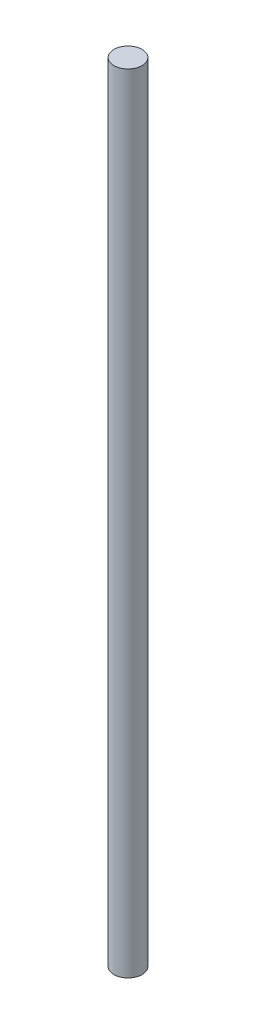
ISO-10303-21;
HEADER;
FILE_DESCRIPTION(('STEP AP214'),'2;1');
FILE_NAME('part.step','',(''),(''),'','','');
FILE_SCHEMA(('AUTOMOTIVE_DESIGN { 1 0 10303 214 1 1 1 1 }'));
ENDSEC;
DATA;
#1=APPLICATION_CONTEXT('core data for automotive mechanical design processes');
#2=APPLICATION_PROTOCOL_DEFINITION('international standard','automotive_design',2000,#1);
#3=PRODUCT_CONTEXT('',#1,'mechanical');
#4=PRODUCT('Part','Part','',(#3));
#5=PRODUCT_RELATED_PRODUCT_CATEGORY('part','',(#4));
#6=PRODUCT_DEFINITION_FORMATION('','',#4);
#7=PRODUCT_DEFINITION_CONTEXT('part definition',#1,'design');
#8=PRODUCT_DEFINITION('design','',#6,#7);
#9=PRODUCT_DEFINITION_SHAPE('','',#8);
#10=(LENGTH_UNIT() NAMED_UNIT(*) SI_UNIT(.MILLI.,.METRE.));
#11=(NAMED_UNIT(*) PLANE_ANGLE_UNIT() SI_UNIT($,.RADIAN.));
#12=(NAMED_UNIT(*) SI_UNIT($,.STERADIAN.) SOLID_ANGLE_UNIT());
#13=UNCERTAINTY_MEASURE_WITH_UNIT(LENGTH_MEASURE(1.E-05),#10,'distance_accuracy_value','');
#14=(GEOMETRIC_REPRESENTATION_CONTEXT(3) GLOBAL_UNCERTAINTY_ASSIGNED_CONTEXT((#13)) GLOBAL_UNIT_ASSIGNED_CONTEXT((#10,
#11,#12)) REPRESENTATION_CONTEXT('',''));
#15=CARTESIAN_POINT('',(0.,0.,0.));
#16=DIRECTION('',(0.,0.,1.));
#17=DIRECTION('',(1.,0.,0.));
#18=AXIS2_PLACEMENT_3D('',#15,#16,#17);
#19=CARTESIAN_POINT('',(0.,84.,0.));
#20=DIRECTION('',(0.,-1.,0.));
#21=DIRECTION('',(0.,0.,-1.));
#22=AXIS2_PLACEMENT_3D('',#19,#20,#21);
#23=CYLINDRICAL_SURFACE('',#22,1.5);
#24=CARTESIAN_POINT('',(0.,84.,0.));
#25=DIRECTION('',(0.,1.,0.));
#26=DIRECTION('',(0.,0.,1.));
#27=AXIS2_PLACEMENT_3D('',#24,#25,#26);
#28=CIRCLE('',#27,1.5);
#29=CARTESIAN_POINT('',(0.,84.,1.5));
#30=VERTEX_POINT('',#29);
#31=EDGE_CURVE('E10',#30,#30,#28,.T.);
#32=ORIENTED_EDGE('',*,*,#31,.F.);
#33=EDGE_LOOP('',(#32));
#34=FACE_BOUND('',#33,.T.);
#35=CARTESIAN_POINT('',(0.,0.,0.));
#36=DIRECTION('',(0.,1.,0.));
#37=DIRECTION('',(0.,0.,1.));
#38=AXIS2_PLACEMENT_3D('',#35,#36,#37);
#39=CIRCLE('',#38,1.5);
#40=CARTESIAN_POINT('',(0.,0.,1.5));
#41=VERTEX_POINT('',#40);
#42=EDGE_CURVE('E40',#41,#41,#39,.T.);
#43=ORIENTED_EDGE('',*,*,#42,.T.);
#44=EDGE_LOOP('',(#43));
#45=FACE_BOUND('',#44,.T.);
#46=ADVANCED_FACE('F37',(#34,#45),#23,.T.);
#47=CARTESIAN_POINT('',(0.,84.,0.));
#48=DIRECTION('',(0.,1.,0.));
#49=DIRECTION('',(0.,0.,1.));
#50=AXIS2_PLACEMENT_3D('',#47,#48,#49);
#51=PLANE('',#50);
#52=ORIENTED_EDGE('',*,*,#31,.T.);
#53=EDGE_LOOP('',(#52));
#54=FACE_BOUND('',#53,.T.);
#55=ADVANCED_FACE('F54',(#54),#51,.T.);
#56=CARTESIAN_POINT('',(0.,0.,0.));
#57=DIRECTION('',(0.,1.,0.));
#58=DIRECTION('',(0.,0.,1.));
#59=AXIS2_PLACEMENT_3D('',#56,#57,#58);
#60=PLANE('',#59);
#61=ORIENTED_EDGE('',*,*,#42,.F.);
#62=EDGE_LOOP('',(#61));
#63=FACE_BOUND('',#62,.T.);
#64=ADVANCED_FACE('F52',(#63),#60,.F.);
#65=CLOSED_SHELL('',(#46,#55,#64));
#66=MANIFOLD_SOLID_BREP('B2',#65);
#67=ADVANCED_BREP_SHAPE_REPRESENTATION('',(#18,#66),#14);
#68=SHAPE_DEFINITION_REPRESENTATION(#9,#67);
ENDSEC;
END-ISO-10303-21;
